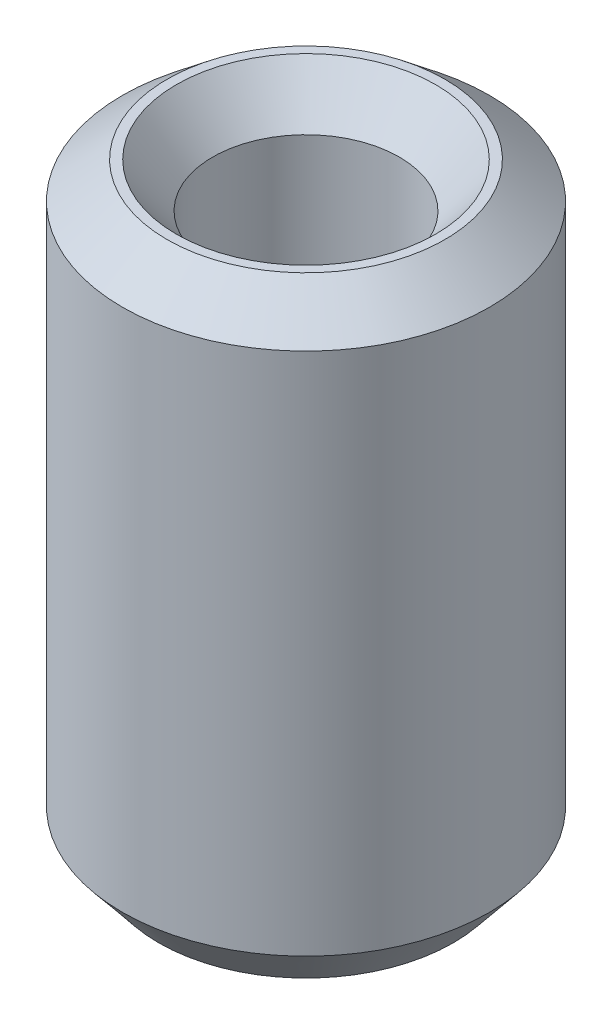
ISO-10303-21;
HEADER;
FILE_DESCRIPTION(('STEP AP214'),'2;1');
FILE_NAME('part.step','',(''),(''),'','','');
FILE_SCHEMA(('AUTOMOTIVE_DESIGN { 1 0 10303 214 1 1 1 1 }'));
ENDSEC;
DATA;
#1=APPLICATION_CONTEXT('core data for automotive mechanical design processes');
#2=APPLICATION_PROTOCOL_DEFINITION('international standard','automotive_design',2000,#1);
#3=PRODUCT_CONTEXT('',#1,'mechanical');
#4=PRODUCT('Part','Part','',(#3));
#5=PRODUCT_RELATED_PRODUCT_CATEGORY('part','',(#4));
#6=PRODUCT_DEFINITION_FORMATION('','',#4);
#7=PRODUCT_DEFINITION_CONTEXT('part definition',#1,'design');
#8=PRODUCT_DEFINITION('design','',#6,#7);
#9=PRODUCT_DEFINITION_SHAPE('','',#8);
#10=(LENGTH_UNIT() NAMED_UNIT(*) SI_UNIT(.MILLI.,.METRE.));
#11=(NAMED_UNIT(*) PLANE_ANGLE_UNIT() SI_UNIT($,.RADIAN.));
#12=(NAMED_UNIT(*) SI_UNIT($,.STERADIAN.) SOLID_ANGLE_UNIT());
#13=UNCERTAINTY_MEASURE_WITH_UNIT(LENGTH_MEASURE(1.E-05),#10,'distance_accuracy_value','');
#14=(GEOMETRIC_REPRESENTATION_CONTEXT(3) GLOBAL_UNCERTAINTY_ASSIGNED_CONTEXT((#13)) GLOBAL_UNIT_ASSIGNED_CONTEXT((#10,
#11,#12)) REPRESENTATION_CONTEXT('',''));
#15=CARTESIAN_POINT('',(0.,0.,0.));
#16=DIRECTION('',(0.,0.,1.));
#17=DIRECTION('',(1.,0.,0.));
#18=AXIS2_PLACEMENT_3D('',#15,#16,#17);
#19=CARTESIAN_POINT('',(0.,24.7196924534868,0.));
#20=DIRECTION('',(0.,-1.,0.));
#21=DIRECTION('',(0.,0.,-1.));
#22=AXIS2_PLACEMENT_3D('',#19,#20,#21);
#23=CYLINDRICAL_SURFACE('',#22,7.5);
#24=CARTESIAN_POINT('',(0.,1.82290254788374,0.));
#25=DIRECTION('',(0.,1.,0.));
#26=DIRECTION('',(0.,0.,1.));
#27=AXIS2_PLACEMENT_3D('',#24,#25,#26);
#28=CIRCLE('',#27,7.5);
#29=CARTESIAN_POINT('',(0.,1.82290254788374,7.5));
#30=VERTEX_POINT('',#29);
#31=EDGE_CURVE('E10',#30,#30,#28,.T.);
#32=ORIENTED_EDGE('',*,*,#31,.T.);
#33=EDGE_LOOP('',(#32));
#34=FACE_BOUND('',#33,.T.);
#35=CARTESIAN_POINT('',(0.,23.2374651684864,0.));
#36=DIRECTION('',(0.,1.,0.));
#37=DIRECTION('',(0.,0.,1.));
#38=AXIS2_PLACEMENT_3D('',#35,#36,#37);
#39=CIRCLE('',#38,7.5);
#40=CARTESIAN_POINT('',(0.,23.2374651684864,7.5));
#41=VERTEX_POINT('',#40);
#42=EDGE_CURVE('E50',#41,#41,#39,.F.);
#43=ORIENTED_EDGE('',*,*,#42,.T.);
#44=EDGE_LOOP('',(#43));
#45=FACE_BOUND('',#44,.T.);
#46=ADVANCED_FACE('F39',(#34,#45),#23,.T.);
#47=CARTESIAN_POINT('',(0.,24.7196924534868,0.));
#48=DIRECTION('',(0.,1.,0.));
#49=DIRECTION('',(0.,0.,1.));
#50=AXIS2_PLACEMENT_3D('',#47,#48,#49);
#51=PLANE('',#50);
#52=CARTESIAN_POINT('',(0.,24.7196924534868,0.));
#53=DIRECTION('',(0.,1.,0.));
#54=DIRECTION('',(0.,0.,1.));
#55=AXIS2_PLACEMENT_3D('',#52,#53,#54);
#56=CIRCLE('',#55,5.29697513670165);
#57=CARTESIAN_POINT('',(0.,24.7196924534868,5.29697513670165));
#58=VERTEX_POINT('',#57);
#59=EDGE_CURVE('E58',#58,#58,#56,.F.);
#60=ORIENTED_EDGE('',*,*,#59,.T.);
#61=EDGE_LOOP('',(#60));
#62=FACE_BOUND('',#61,.T.);
#63=CARTESIAN_POINT('',(0.,24.7196924534868,0.));
#64=DIRECTION('',(0.,1.,0.));
#65=DIRECTION('',(0.,0.,1.));
#66=AXIS2_PLACEMENT_3D('',#63,#64,#65);
#67=CIRCLE('',#66,5.67709745211626);
#68=CARTESIAN_POINT('',(0.,24.7196924534868,5.67709745211626));
#69=VERTEX_POINT('',#68);
#70=EDGE_CURVE('E61',#69,#69,#67,.T.);
#71=ORIENTED_EDGE('',*,*,#70,.T.);
#72=EDGE_LOOP('',(#71));
#73=FACE_BOUND('',#72,.T.);
#74=ADVANCED_FACE('F88',(#62,#73),#51,.T.);
#75=CARTESIAN_POINT('',(0.,0.,0.));
#76=DIRECTION('',(0.,1.,0.));
#77=DIRECTION('',(0.,0.,1.));
#78=AXIS2_PLACEMENT_3D('',#75,#76,#77);
#79=PLANE('',#78);
#80=CARTESIAN_POINT('',(0.,0.,0.));
#81=DIRECTION('',(0.,1.,0.));
#82=DIRECTION('',(0.,0.,1.));
#83=AXIS2_PLACEMENT_3D('',#80,#81,#82);
#84=CIRCLE('',#83,5.63765039958504);
#85=CARTESIAN_POINT('',(0.,0.,5.63765039958504));
#86=VERTEX_POINT('',#85);
#87=EDGE_CURVE('E51',#86,#86,#84,.T.);
#88=ORIENTED_EDGE('',*,*,#87,.T.);
#89=EDGE_LOOP('',(#88));
#90=FACE_BOUND('',#89,.T.);
#91=CARTESIAN_POINT('',(0.,0.,0.));
#92=DIRECTION('',(0.,1.,0.));
#93=DIRECTION('',(0.,0.,1.));
#94=AXIS2_PLACEMENT_3D('',#91,#92,#93);
#95=CIRCLE('',#94,6.01777271499966);
#96=CARTESIAN_POINT('',(0.,0.,6.01777271499966));
#97=VERTEX_POINT('',#96);
#98=EDGE_CURVE('E54',#97,#97,#95,.F.);
#99=ORIENTED_EDGE('',*,*,#98,.T.);
#100=EDGE_LOOP('',(#99));
#101=FACE_BOUND('',#100,.T.);
#102=ADVANCED_FACE('F83',(#90,#101),#79,.F.);
#103=CARTESIAN_POINT('',(0.,24.7196924534868,0.));
#104=DIRECTION('',(0.,-1.,0.));
#105=DIRECTION('',(0.,0.,-1.));
#106=AXIS2_PLACEMENT_3D('',#103,#104,#105);
#107=CYLINDRICAL_SURFACE('',#106,3.81474785170131);
#108=CARTESIAN_POINT('',(0.,22.896789905603,0.));
#109=DIRECTION('',(0.,1.,0.));
#110=DIRECTION('',(0.,0.,1.));
#111=AXIS2_PLACEMENT_3D('',#108,#109,#110);
#112=CIRCLE('',#111,3.81474785170131);
#113=CARTESIAN_POINT('',(0.,22.896789905603,3.81474785170131));
#114=VERTEX_POINT('',#113);
#115=EDGE_CURVE('E67',#114,#114,#112,.T.);
#116=ORIENTED_EDGE('',*,*,#115,.T.);
#117=EDGE_LOOP('',(#116));
#118=FACE_BOUND('',#117,.T.);
#119=CARTESIAN_POINT('',(0.,1.48222728500034,0.));
#120=DIRECTION('',(0.,1.,0.));
#121=DIRECTION('',(0.,0.,1.));
#122=AXIS2_PLACEMENT_3D('',#119,#120,#121);
#123=CIRCLE('',#122,3.81474785170131);
#124=CARTESIAN_POINT('',(0.,1.48222728500034,3.81474785170131));
#125=VERTEX_POINT('',#124);
#126=EDGE_CURVE('E69',#125,#125,#123,.F.);
#127=ORIENTED_EDGE('',*,*,#126,.T.);
#128=EDGE_LOOP('',(#127));
#129=FACE_BOUND('',#128,.T.);
#130=ADVANCED_FACE('F71',(#118,#129),#107,.F.);
#131=CARTESIAN_POINT('',(0.,22.896789905603,0.));
#132=DIRECTION('',(0.,1.,0.));
#133=DIRECTION('',(0.,0.,1.));
#134=AXIS2_PLACEMENT_3D('',#131,#132,#133);
#135=CONICAL_SURFACE('',#134,3.81474785170131,0.682686190273144);
#136=ORIENTED_EDGE('',*,*,#59,.F.);
#137=EDGE_LOOP('',(#136));
#138=FACE_BOUND('',#137,.T.);
#139=ORIENTED_EDGE('',*,*,#115,.F.);
#140=EDGE_LOOP('',(#139));
#141=FACE_BOUND('',#140,.T.);
#142=ADVANCED_FACE('F77',(#138,#141),#135,.F.);
#143=CARTESIAN_POINT('',(0.,0.,0.));
#144=DIRECTION('',(0.,-1.,0.));
#145=DIRECTION('',(0.,0.,-1.));
#146=AXIS2_PLACEMENT_3D('',#143,#144,#145);
#147=CONICAL_SURFACE('',#146,5.63765039958504,0.888110136521751);
#148=ORIENTED_EDGE('',*,*,#126,.F.);
#149=EDGE_LOOP('',(#148));
#150=FACE_BOUND('',#149,.T.);
#151=ORIENTED_EDGE('',*,*,#87,.F.);
#152=EDGE_LOOP('',(#151));
#153=FACE_BOUND('',#152,.T.);
#154=ADVANCED_FACE('F73',(#150,#153),#147,.F.);
#155=CARTESIAN_POINT('',(0.,1.82290254788374,0.));
#156=DIRECTION('',(0.,1.,0.));
#157=DIRECTION('',(0.,0.,1.));
#158=AXIS2_PLACEMENT_3D('',#155,#156,#157);
#159=CONICAL_SURFACE('',#158,7.5,0.682686190273145);
#160=ORIENTED_EDGE('',*,*,#98,.F.);
#161=EDGE_LOOP('',(#160));
#162=FACE_BOUND('',#161,.T.);
#163=ORIENTED_EDGE('',*,*,#31,.F.);
#164=EDGE_LOOP('',(#163));
#165=FACE_BOUND('',#164,.T.);
#166=ADVANCED_FACE('F76',(#162,#165),#159,.T.);
#167=CARTESIAN_POINT('',(0.,24.7196924534868,0.));
#168=DIRECTION('',(0.,-1.,0.));
#169=DIRECTION('',(0.,0.,-1.));
#170=AXIS2_PLACEMENT_3D('',#167,#168,#169);
#171=CONICAL_SURFACE('',#170,5.67709745211626,0.88811013652175);
#172=ORIENTED_EDGE('',*,*,#42,.F.);
#173=EDGE_LOOP('',(#172));
#174=FACE_BOUND('',#173,.T.);
#175=ORIENTED_EDGE('',*,*,#70,.F.);
#176=EDGE_LOOP('',(#175));
#177=FACE_BOUND('',#176,.T.);
#178=ADVANCED_FACE('F45',(#174,#177),#171,.T.);
#179=CLOSED_SHELL('',(#46,#74,#102,#130,#142,#154,#166,#178));
#180=MANIFOLD_SOLID_BREP('B2',#179);
#181=ADVANCED_BREP_SHAPE_REPRESENTATION('',(#18,#180),#14);
#182=SHAPE_DEFINITION_REPRESENTATION(#9,#181);
ENDSEC;
END-ISO-10303-21;
